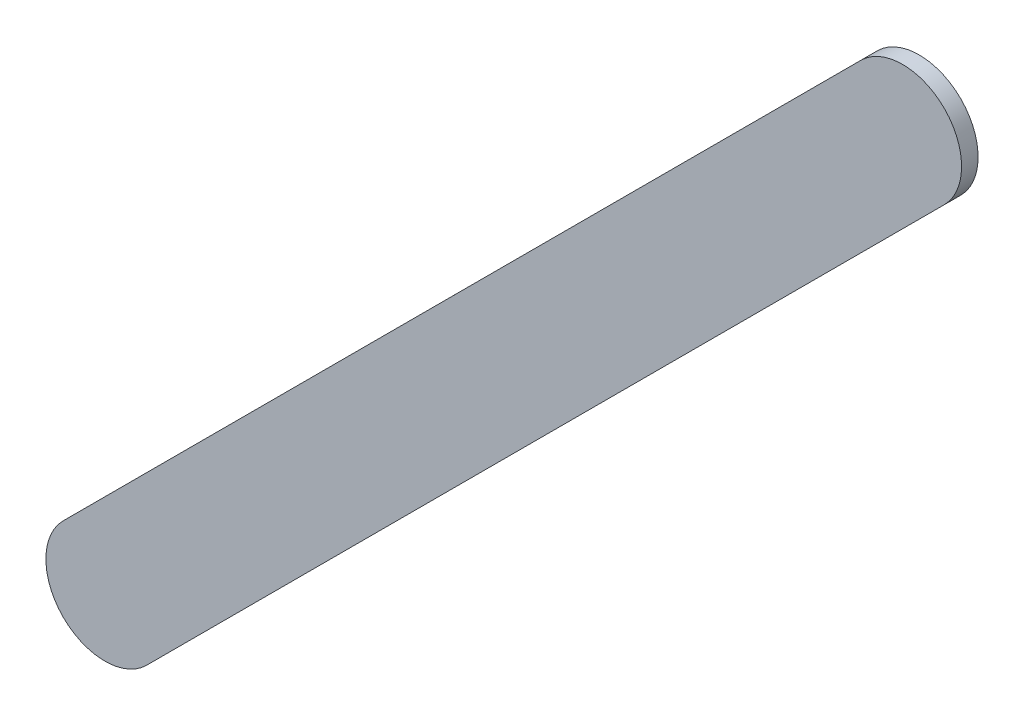
ISO-10303-21;
HEADER;
FILE_DESCRIPTION(('STEP AP214'),'2;1');
FILE_NAME('part.step','',(''),(''),'','','');
FILE_SCHEMA(('AUTOMOTIVE_DESIGN { 1 0 10303 214 1 1 1 1 }'));
ENDSEC;
DATA;
#1=APPLICATION_CONTEXT('core data for automotive mechanical design processes');
#2=APPLICATION_PROTOCOL_DEFINITION('international standard','automotive_design',2000,#1);
#3=PRODUCT_CONTEXT('',#1,'mechanical');
#4=PRODUCT('Part','Part','',(#3));
#5=PRODUCT_RELATED_PRODUCT_CATEGORY('part','',(#4));
#6=PRODUCT_DEFINITION_FORMATION('','',#4);
#7=PRODUCT_DEFINITION_CONTEXT('part definition',#1,'design');
#8=PRODUCT_DEFINITION('design','',#6,#7);
#9=PRODUCT_DEFINITION_SHAPE('','',#8);
#10=(LENGTH_UNIT() NAMED_UNIT(*) SI_UNIT(.MILLI.,.METRE.));
#11=(NAMED_UNIT(*) PLANE_ANGLE_UNIT() SI_UNIT($,.RADIAN.));
#12=(NAMED_UNIT(*) SI_UNIT($,.STERADIAN.) SOLID_ANGLE_UNIT());
#13=UNCERTAINTY_MEASURE_WITH_UNIT(LENGTH_MEASURE(1.E-05),#10,'distance_accuracy_value','');
#14=(GEOMETRIC_REPRESENTATION_CONTEXT(3) GLOBAL_UNCERTAINTY_ASSIGNED_CONTEXT((#13)) GLOBAL_UNIT_ASSIGNED_CONTEXT((#10,
#11,#12)) REPRESENTATION_CONTEXT('',''));
#15=CARTESIAN_POINT('',(0.,0.,0.));
#16=DIRECTION('',(0.,0.,1.));
#17=DIRECTION('',(1.,0.,0.));
#18=AXIS2_PLACEMENT_3D('',#15,#16,#17);
#19=CARTESIAN_POINT('',(94.56678826,50.89717024,0.));
#20=DIRECTION('',(-0.707106258459462,0.707107303913246,0.));
#21=DIRECTION('',(0.707107303913246,0.707106258459462,0.));
#22=AXIS2_PLACEMENT_3D('',#19,#20,#21);
#23=PLANE('',#22);
#24=DIRECTION('',(0.707107303913246,0.707106258459462,0.));
#25=VECTOR('',#24,1.);
#26=CARTESIAN_POINT('',(94.56678826,50.89717024,0.03556));
#27=LINE('',#26,#25);
#28=CARTESIAN_POINT('',(94.56678826,50.89717024,0.03556));
#29=VERTEX_POINT('',#28);
#30=CARTESIAN_POINT('',(96.28475282,52.61513226,0.03556));
#31=VERTEX_POINT('',#30);
#32=EDGE_CURVE('E11',#29,#31,#27,.T.);
#33=ORIENTED_EDGE('',*,*,#32,.F.);
#34=DIRECTION('',(0.,0.,1.));
#35=VECTOR('',#34,1.);
#36=CARTESIAN_POINT('',(94.56678826,50.89717024,0.));
#37=LINE('',#36,#35);
#38=CARTESIAN_POINT('',(94.56678826,50.89717024,0.));
#39=VERTEX_POINT('',#38);
#40=EDGE_CURVE('E24',#39,#29,#37,.T.);
#41=ORIENTED_EDGE('',*,*,#40,.F.);
#42=DIRECTION('',(0.707107303913246,0.707106258459462,0.));
#43=VECTOR('',#42,1.);
#44=CARTESIAN_POINT('',(94.56678826,50.89717024,0.));
#45=LINE('',#44,#43);
#46=CARTESIAN_POINT('',(96.28475282,52.61513226,0.));
#47=VERTEX_POINT('',#46);
#48=EDGE_CURVE('E75',#39,#47,#45,.T.);
#49=ORIENTED_EDGE('',*,*,#48,.T.);
#50=DIRECTION('',(0.,0.,1.));
#51=VECTOR('',#50,1.);
#52=CARTESIAN_POINT('',(96.28475282,52.61513226,0.));
#53=LINE('',#52,#51);
#54=EDGE_CURVE('E37',#47,#31,#53,.T.);
#55=ORIENTED_EDGE('',*,*,#54,.T.);
#56=EDGE_LOOP('',(#33,#41,#49,#55));
#57=FACE_BOUND('',#56,.T.);
#58=ADVANCED_FACE('F17',(#57),#23,.F.);
#59=CARTESIAN_POINT('',(96.19494985,52.70493523,0.));
#60=DIRECTION('',(0.,0.,-1.));
#61=DIRECTION('',(0.70710678118652,-0.707106781186576,0.));
#62=AXIS2_PLACEMENT_3D('',#59,#60,#61);
#63=CYLINDRICAL_SURFACE('',#62,0.127000578115384);
#64=CARTESIAN_POINT('',(96.19494985,52.70493523,0.03556));
#65=DIRECTION('',(0.,0.,1.));
#66=DIRECTION('',(0.70710678118652,-0.707106781186576,0.));
#67=AXIS2_PLACEMENT_3D('',#64,#65,#66);
#68=CIRCLE('',#67,0.127000578115384);
#69=CARTESIAN_POINT('',(96.10514688,52.7947382,0.03556));
#70=VERTEX_POINT('',#69);
#71=EDGE_CURVE('E83',#31,#70,#68,.T.);
#72=ORIENTED_EDGE('',*,*,#71,.F.);
#73=ORIENTED_EDGE('',*,*,#54,.F.);
#74=CARTESIAN_POINT('',(96.19494985,52.70493523,0.));
#75=DIRECTION('',(0.,0.,1.));
#76=DIRECTION('',(0.70710678118652,-0.707106781186576,0.));
#77=AXIS2_PLACEMENT_3D('',#74,#75,#76);
#78=CIRCLE('',#77,0.127000578115384);
#79=CARTESIAN_POINT('',(96.10514688,52.7947382,0.));
#80=VERTEX_POINT('',#79);
#81=EDGE_CURVE('E81',#47,#80,#78,.T.);
#82=ORIENTED_EDGE('',*,*,#81,.T.);
#83=DIRECTION('',(0.,0.,1.));
#84=VECTOR('',#83,1.);
#85=CARTESIAN_POINT('',(96.10514688,52.7947382,0.));
#86=LINE('',#85,#84);
#87=EDGE_CURVE('E67',#80,#70,#86,.T.);
#88=ORIENTED_EDGE('',*,*,#87,.T.);
#89=EDGE_LOOP('',(#72,#73,#82,#88));
#90=FACE_BOUND('',#89,.T.);
#91=ADVANCED_FACE('F89',(#90),#63,.T.);
#92=CARTESIAN_POINT('',(96.10514688,52.7947382,0.));
#93=DIRECTION('',(0.707107303913246,-0.707106258459462,0.));
#94=DIRECTION('',(-0.707106258459462,-0.707107303913246,0.));
#95=AXIS2_PLACEMENT_3D('',#92,#93,#94);
#96=PLANE('',#95);
#97=DIRECTION('',(-0.707106258459462,-0.707107303913246,0.));
#98=VECTOR('',#97,1.);
#99=CARTESIAN_POINT('',(96.10514688,52.7947382,0.03556));
#100=LINE('',#99,#98);
#101=CARTESIAN_POINT('',(94.38718486,51.07677364,0.03556));
#102=VERTEX_POINT('',#101);
#103=EDGE_CURVE('E71',#70,#102,#100,.T.);
#104=ORIENTED_EDGE('',*,*,#103,.F.);
#105=ORIENTED_EDGE('',*,*,#87,.F.);
#106=DIRECTION('',(-0.707106258459462,-0.707107303913246,0.));
#107=VECTOR('',#106,1.);
#108=CARTESIAN_POINT('',(96.10514688,52.7947382,0.));
#109=LINE('',#108,#107);
#110=CARTESIAN_POINT('',(94.38718486,51.07677364,0.));
#111=VERTEX_POINT('',#110);
#112=EDGE_CURVE('E63',#80,#111,#109,.T.);
#113=ORIENTED_EDGE('',*,*,#112,.T.);
#114=DIRECTION('',(0.,0.,1.));
#115=VECTOR('',#114,1.);
#116=CARTESIAN_POINT('',(94.38718486,51.07677364,0.));
#117=LINE('',#116,#115);
#118=EDGE_CURVE('E53',#111,#102,#117,.T.);
#119=ORIENTED_EDGE('',*,*,#118,.T.);
#120=EDGE_LOOP('',(#104,#105,#113,#119));
#121=FACE_BOUND('',#120,.T.);
#122=ADVANCED_FACE('F66',(#121),#96,.F.);
#123=CARTESIAN_POINT('',(94.47698656,50.98697194,0.));
#124=DIRECTION('',(0.,0.,-1.));
#125=DIRECTION('',(-0.707106781186576,0.70710678118652,0.));
#126=AXIS2_PLACEMENT_3D('',#123,#124,#125);
#127=CYLINDRICAL_SURFACE('',#126,0.126998782064165);
#128=CARTESIAN_POINT('',(94.47698656,50.98697194,0.03556));
#129=DIRECTION('',(0.,0.,1.));
#130=DIRECTION('',(-0.707106781186576,0.70710678118652,0.));
#131=AXIS2_PLACEMENT_3D('',#128,#129,#130);
#132=CIRCLE('',#131,0.126998782064165);
#133=EDGE_CURVE('E59',#102,#29,#132,.T.);
#134=ORIENTED_EDGE('',*,*,#133,.F.);
#135=ORIENTED_EDGE('',*,*,#118,.F.);
#136=CARTESIAN_POINT('',(94.47698656,50.98697194,0.));
#137=DIRECTION('',(0.,0.,1.));
#138=DIRECTION('',(-0.707106781186576,0.70710678118652,0.));
#139=AXIS2_PLACEMENT_3D('',#136,#137,#138);
#140=CIRCLE('',#139,0.126998782064165);
#141=EDGE_CURVE('E57',#111,#39,#140,.T.);
#142=ORIENTED_EDGE('',*,*,#141,.T.);
#143=ORIENTED_EDGE('',*,*,#40,.T.);
#144=EDGE_LOOP('',(#134,#135,#142,#143));
#145=FACE_BOUND('',#144,.T.);
#146=ADVANCED_FACE('F55',(#145),#127,.T.);
#147=CARTESIAN_POINT('',(94.56678826,50.89717024,0.));
#148=DIRECTION('',(0.,0.,-1.));
#149=DIRECTION('',(-1.,0.,0.));
#150=AXIS2_PLACEMENT_3D('',#147,#148,#149);
#151=PLANE('',#150);
#152=ORIENTED_EDGE('',*,*,#141,.F.);
#153=ORIENTED_EDGE('',*,*,#112,.F.);
#154=ORIENTED_EDGE('',*,*,#81,.F.);
#155=ORIENTED_EDGE('',*,*,#48,.F.);
#156=EDGE_LOOP('',(#152,#153,#154,#155));
#157=FACE_BOUND('',#156,.T.);
#158=ADVANCED_FACE('F74',(#157),#151,.T.);
#159=CARTESIAN_POINT('',(94.56678826,50.89717024,0.03556));
#160=DIRECTION('',(0.,0.,-1.));
#161=DIRECTION('',(-1.,0.,0.));
#162=AXIS2_PLACEMENT_3D('',#159,#160,#161);
#163=PLANE('',#162);
#164=ORIENTED_EDGE('',*,*,#32,.T.);
#165=ORIENTED_EDGE('',*,*,#71,.T.);
#166=ORIENTED_EDGE('',*,*,#103,.T.);
#167=ORIENTED_EDGE('',*,*,#133,.T.);
#168=EDGE_LOOP('',(#164,#165,#166,#167));
#169=FACE_BOUND('',#168,.T.);
#170=ADVANCED_FACE('F91',(#169),#163,.F.);
#171=CLOSED_SHELL('',(#58,#91,#122,#146,#158,#170));
#172=MANIFOLD_SOLID_BREP('B1',#171);
#173=ADVANCED_BREP_SHAPE_REPRESENTATION('',(#18,#172),#14);
#174=SHAPE_DEFINITION_REPRESENTATION(#9,#173);
ENDSEC;
END-ISO-10303-21;
